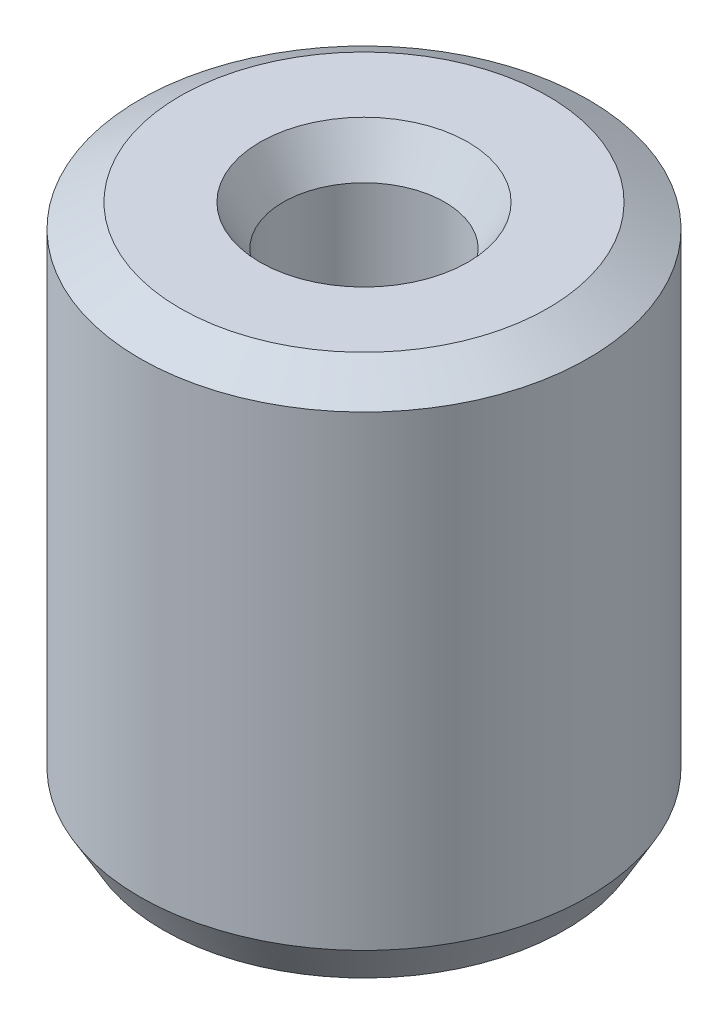
ISO-10303-21;
HEADER;
FILE_DESCRIPTION(('STEP AP214'),'2;1');
FILE_NAME('part.step','',(''),(''),'','','');
FILE_SCHEMA(('AUTOMOTIVE_DESIGN { 1 0 10303 214 1 1 1 1 }'));
ENDSEC;
DATA;
#1=APPLICATION_CONTEXT('core data for automotive mechanical design processes');
#2=APPLICATION_PROTOCOL_DEFINITION('international standard','automotive_design',2000,#1);
#3=PRODUCT_CONTEXT('',#1,'mechanical');
#4=PRODUCT('Part','Part','',(#3));
#5=PRODUCT_RELATED_PRODUCT_CATEGORY('part','',(#4));
#6=PRODUCT_DEFINITION_FORMATION('','',#4);
#7=PRODUCT_DEFINITION_CONTEXT('part definition',#1,'design');
#8=PRODUCT_DEFINITION('design','',#6,#7);
#9=PRODUCT_DEFINITION_SHAPE('','',#8);
#10=(LENGTH_UNIT() NAMED_UNIT(*) SI_UNIT(.MILLI.,.METRE.));
#11=(NAMED_UNIT(*) PLANE_ANGLE_UNIT() SI_UNIT($,.RADIAN.));
#12=(NAMED_UNIT(*) SI_UNIT($,.STERADIAN.) SOLID_ANGLE_UNIT());
#13=UNCERTAINTY_MEASURE_WITH_UNIT(LENGTH_MEASURE(1.E-05),#10,'distance_accuracy_value','');
#14=(GEOMETRIC_REPRESENTATION_CONTEXT(3) GLOBAL_UNCERTAINTY_ASSIGNED_CONTEXT((#13)) GLOBAL_UNIT_ASSIGNED_CONTEXT((#10,
#11,#12)) REPRESENTATION_CONTEXT('',''));
#15=CARTESIAN_POINT('',(0.,0.,0.));
#16=DIRECTION('',(0.,0.,1.));
#17=DIRECTION('',(1.,0.,0.));
#18=AXIS2_PLACEMENT_3D('',#15,#16,#17);
#19=CARTESIAN_POINT('',(0.,29.5413175582798,0.));
#20=DIRECTION('',(0.,-1.,0.));
#21=DIRECTION('',(0.,0.,-1.));
#22=AXIS2_PLACEMENT_3D('',#19,#20,#21);
#23=CYLINDRICAL_SURFACE('',#22,12.5);
#24=CARTESIAN_POINT('',(0.,2.24704750951922,0.));
#25=DIRECTION('',(0.,1.,0.));
#26=DIRECTION('',(0.,0.,1.));
#27=AXIS2_PLACEMENT_3D('',#24,#25,#26);
#28=CIRCLE('',#27,12.5);
#29=CARTESIAN_POINT('',(0.,2.24704750951922,12.5));
#30=VERTEX_POINT('',#29);
#31=EDGE_CURVE('E10',#30,#30,#28,.T.);
#32=ORIENTED_EDGE('',*,*,#31,.T.);
#33=EDGE_LOOP('',(#32));
#34=FACE_BOUND('',#33,.T.);
#35=CARTESIAN_POINT('',(0.,28.243984073777,0.));
#36=DIRECTION('',(0.,1.,0.));
#37=DIRECTION('',(0.,0.,1.));
#38=AXIS2_PLACEMENT_3D('',#35,#36,#37);
#39=CIRCLE('',#38,12.5);
#40=CARTESIAN_POINT('',(0.,28.243984073777,12.5));
#41=VERTEX_POINT('',#40);
#42=EDGE_CURVE('E50',#41,#41,#39,.F.);
#43=ORIENTED_EDGE('',*,*,#42,.T.);
#44=EDGE_LOOP('',(#43));
#45=FACE_BOUND('',#44,.T.);
#46=ADVANCED_FACE('F39',(#34,#45),#23,.T.);
#47=CARTESIAN_POINT('',(0.,29.5413175582798,0.));
#48=DIRECTION('',(0.,1.,0.));
#49=DIRECTION('',(0.,0.,1.));
#50=AXIS2_PLACEMENT_3D('',#47,#48,#49);
#51=PLANE('',#50);
#52=CARTESIAN_POINT('',(0.,29.5413175582798,0.));
#53=DIRECTION('',(0.,1.,0.));
#54=DIRECTION('',(0.,0.,1.));
#55=AXIS2_PLACEMENT_3D('',#52,#53,#54);
#56=CIRCLE('',#55,5.80007910251227);
#57=CARTESIAN_POINT('',(0.,29.5413175582798,5.80007910251227));
#58=VERTEX_POINT('',#57);
#59=EDGE_CURVE('E58',#58,#58,#56,.F.);
#60=ORIENTED_EDGE('',*,*,#59,.T.);
#61=EDGE_LOOP('',(#60));
#62=FACE_BOUND('',#61,.T.);
#63=CARTESIAN_POINT('',(0.,29.5413175582798,0.));
#64=DIRECTION('',(0.,1.,0.));
#65=DIRECTION('',(0.,0.,1.));
#66=AXIS2_PLACEMENT_3D('',#63,#64,#65);
#67=CIRCLE('',#66,10.2529524904808);
#68=CARTESIAN_POINT('',(0.,29.5413175582798,10.2529524904808));
#69=VERTEX_POINT('',#68);
#70=EDGE_CURVE('E61',#69,#69,#67,.T.);
#71=ORIENTED_EDGE('',*,*,#70,.T.);
#72=EDGE_LOOP('',(#71));
#73=FACE_BOUND('',#72,.T.);
#74=ADVANCED_FACE('F88',(#62,#73),#51,.T.);
#75=CARTESIAN_POINT('',(0.,0.,0.));
#76=DIRECTION('',(0.,1.,0.));
#77=DIRECTION('',(0.,0.,1.));
#78=AXIS2_PLACEMENT_3D('',#75,#76,#77);
#79=PLANE('',#78);
#80=CARTESIAN_POINT('',(0.,0.,0.));
#81=DIRECTION('',(0.,1.,0.));
#82=DIRECTION('',(0.,0.,1.));
#83=AXIS2_PLACEMENT_3D('',#80,#81,#82);
#84=CIRCLE('',#83,6.74979312752869);
#85=CARTESIAN_POINT('',(0.,0.,6.74979312752869));
#86=VERTEX_POINT('',#85);
#87=EDGE_CURVE('E51',#86,#86,#84,.T.);
#88=ORIENTED_EDGE('',*,*,#87,.T.);
#89=EDGE_LOOP('',(#88));
#90=FACE_BOUND('',#89,.T.);
#91=CARTESIAN_POINT('',(0.,0.,0.));
#92=DIRECTION('',(0.,1.,0.));
#93=DIRECTION('',(0.,0.,1.));
#94=AXIS2_PLACEMENT_3D('',#91,#92,#93);
#95=CIRCLE('',#94,11.2026665154972);
#96=CARTESIAN_POINT('',(0.,0.,11.2026665154972));
#97=VERTEX_POINT('',#96);
#98=EDGE_CURVE('E54',#97,#97,#95,.F.);
#99=ORIENTED_EDGE('',*,*,#98,.T.);
#100=EDGE_LOOP('',(#99));
#101=FACE_BOUND('',#100,.T.);
#102=ADVANCED_FACE('F83',(#90,#101),#79,.F.);
#103=CARTESIAN_POINT('',(0.,29.5413175582798,0.));
#104=DIRECTION('',(0.,-1.,0.));
#105=DIRECTION('',(0.,0.,-1.));
#106=AXIS2_PLACEMENT_3D('',#103,#104,#105);
#107=CYLINDRICAL_SURFACE('',#106,4.50274561800946);
#108=CARTESIAN_POINT('',(0.,27.2942700487606,0.));
#109=DIRECTION('',(0.,1.,0.));
#110=DIRECTION('',(0.,0.,1.));
#111=AXIS2_PLACEMENT_3D('',#108,#109,#110);
#112=CIRCLE('',#111,4.50274561800946);
#113=CARTESIAN_POINT('',(0.,27.2942700487606,4.50274561800946));
#114=VERTEX_POINT('',#113);
#115=EDGE_CURVE('E67',#114,#114,#112,.T.);
#116=ORIENTED_EDGE('',*,*,#115,.T.);
#117=EDGE_LOOP('',(#116));
#118=FACE_BOUND('',#117,.T.);
#119=CARTESIAN_POINT('',(0.,1.29733348450282,0.));
#120=DIRECTION('',(0.,1.,0.));
#121=DIRECTION('',(0.,0.,1.));
#122=AXIS2_PLACEMENT_3D('',#119,#120,#121);
#123=CIRCLE('',#122,4.50274561800946);
#124=CARTESIAN_POINT('',(0.,1.29733348450282,4.50274561800946));
#125=VERTEX_POINT('',#124);
#126=EDGE_CURVE('E69',#125,#125,#123,.F.);
#127=ORIENTED_EDGE('',*,*,#126,.T.);
#128=EDGE_LOOP('',(#127));
#129=FACE_BOUND('',#128,.T.);
#130=ADVANCED_FACE('F71',(#118,#129),#107,.F.);
#131=CARTESIAN_POINT('',(0.,27.2942700487606,0.));
#132=DIRECTION('',(0.,1.,0.));
#133=DIRECTION('',(0.,0.,1.));
#134=AXIS2_PLACEMENT_3D('',#131,#132,#133);
#135=CONICAL_SURFACE('',#134,4.50274561800946,0.523598775598303);
#136=ORIENTED_EDGE('',*,*,#59,.F.);
#137=EDGE_LOOP('',(#136));
#138=FACE_BOUND('',#137,.T.);
#139=ORIENTED_EDGE('',*,*,#115,.F.);
#140=EDGE_LOOP('',(#139));
#141=FACE_BOUND('',#140,.T.);
#142=ADVANCED_FACE('F77',(#138,#141),#135,.F.);
#143=CARTESIAN_POINT('',(0.,0.,0.));
#144=DIRECTION('',(0.,-1.,0.));
#145=DIRECTION('',(0.,0.,-1.));
#146=AXIS2_PLACEMENT_3D('',#143,#144,#145);
#147=CONICAL_SURFACE('',#146,6.74979312752869,1.04719755119659);
#148=ORIENTED_EDGE('',*,*,#126,.F.);
#149=EDGE_LOOP('',(#148));
#150=FACE_BOUND('',#149,.T.);
#151=ORIENTED_EDGE('',*,*,#87,.F.);
#152=EDGE_LOOP('',(#151));
#153=FACE_BOUND('',#152,.T.);
#154=ADVANCED_FACE('F73',(#150,#153),#147,.F.);
#155=CARTESIAN_POINT('',(0.,2.24704750951922,0.));
#156=DIRECTION('',(0.,1.,0.));
#157=DIRECTION('',(0.,0.,1.));
#158=AXIS2_PLACEMENT_3D('',#155,#156,#157);
#159=CONICAL_SURFACE('',#158,12.5,0.523598775598303);
#160=CARTESIAN_POINT('',(0.,0.,11.2026665154972));
#161=CARTESIAN_POINT('',(0.,0.0234067448908251,11.2161804059608));
#162=CARTESIAN_POINT('',(0.,0.0468134897816502,11.2296942964243));
#163=CARTESIAN_POINT('',(0.,0.0936269795633006,11.2567220773515));
#164=CARTESIAN_POINT('',(0.,0.117033724454126,11.270235967815));
#165=CARTESIAN_POINT('',(0.,0.163847214235776,11.2972637487422));
#166=CARTESIAN_POINT('',(0.,0.187253959126602,11.3107776392058));
#167=CARTESIAN_POINT('',(0.,0.234067448908252,11.3378054201329));
#168=CARTESIAN_POINT('',(0.,0.257474193799077,11.3513193105965));
#169=CARTESIAN_POINT('',(0.,0.304287683580728,11.3783470915236));
#170=CARTESIAN_POINT('',(0.,0.327694428471553,11.3918609819872));
#171=CARTESIAN_POINT('',(0.,0.374507918253203,11.4188887629143));
#172=CARTESIAN_POINT('',(0.,0.397914663144029,11.4324026533779));
#173=CARTESIAN_POINT('',(0.,0.444728152925679,11.459430434305));
#174=CARTESIAN_POINT('',(0.,0.468134897816505,11.4729443247686));
#175=CARTESIAN_POINT('',(0.,0.514948387598155,11.4999721056957));
#176=CARTESIAN_POINT('',(0.,0.53835513248898,11.5134859961593));
#177=CARTESIAN_POINT('',(0.,0.585168622270631,11.5405137770865));
#178=CARTESIAN_POINT('',(0.,0.608575367161456,11.55402766755));
#179=CARTESIAN_POINT('',(0.,0.655388856943107,11.5810554484772));
#180=CARTESIAN_POINT('',(0.,0.678795601833932,11.5945693389407));
#181=CARTESIAN_POINT('',(0.,0.725609091615582,11.6215971198679));
#182=CARTESIAN_POINT('',(0.,0.749015836506408,11.6351110103315));
#183=CARTESIAN_POINT('',(0.,0.795829326288058,11.6621387912586));
#184=CARTESIAN_POINT('',(0.,0.819236071178883,11.6756526817222));
#185=CARTESIAN_POINT('',(0.,0.866049560960534,11.7026804626493));
#186=CARTESIAN_POINT('',(0.,0.889456305851359,11.7161943531129));
#187=CARTESIAN_POINT('',(0.,0.93626979563301,11.74322213404));
#188=CARTESIAN_POINT('',(0.,0.959676540523835,11.7567360245036));
#189=CARTESIAN_POINT('',(0.,1.00649003030549,11.7837638054307));
#190=CARTESIAN_POINT('',(0.,1.02989677519631,11.7972776958943));
#191=CARTESIAN_POINT('',(0.,1.07671026497796,11.8243054768215));
#192=CARTESIAN_POINT('',(0.,1.10011700986879,11.837819367285));
#193=CARTESIAN_POINT('',(0.,1.14693049965044,11.8648471482122));
#194=CARTESIAN_POINT('',(0.,1.17033724454126,11.8783610386757));
#195=CARTESIAN_POINT('',(0.,1.21715073432291,11.9053888196029));
#196=CARTESIAN_POINT('',(0.,1.24055747921374,11.9189027100664));
#197=CARTESIAN_POINT('',(0.,1.28737096899539,11.9459304909936));
#198=CARTESIAN_POINT('',(0.,1.31077771388621,11.9594443814572));
#199=CARTESIAN_POINT('',(0.,1.35759120366786,11.9864721623843));
#200=CARTESIAN_POINT('',(0.,1.38099794855869,11.9999860528479));
#201=CARTESIAN_POINT('',(0.,1.42781143834034,12.027013833775));
#202=CARTESIAN_POINT('',(0.,1.45121818323117,12.0405277242386));
#203=CARTESIAN_POINT('',(0.,1.49803167301282,12.0675555051657));
#204=CARTESIAN_POINT('',(0.,1.52143841790364,12.0810693956293));
#205=CARTESIAN_POINT('',(0.,1.56825190768529,12.1080971765564));
#206=CARTESIAN_POINT('',(0.,1.59165865257612,12.12161106702));
#207=CARTESIAN_POINT('',(0.,1.63847214235777,12.1486388479472));
#208=CARTESIAN_POINT('',(0.,1.66187888724859,12.1621527384107));
#209=CARTESIAN_POINT('',(0.,1.70869237703024,12.1891805193379));
#210=CARTESIAN_POINT('',(0.,1.73209912192107,12.2026944098014));
#211=CARTESIAN_POINT('',(0.,1.77891261170272,12.2297221907286));
#212=CARTESIAN_POINT('',(0.,1.80231935659354,12.2432360811922));
#213=CARTESIAN_POINT('',(0.,1.84913284637519,12.2702638621193));
#214=CARTESIAN_POINT('',(0.,1.87253959126602,12.2837777525829));
#215=CARTESIAN_POINT('',(0.,1.91935308104767,12.31080553351));
#216=CARTESIAN_POINT('',(0.,1.9427598259385,12.3243194239736));
#217=CARTESIAN_POINT('',(0.,1.98957331572015,12.3513472049007));
#218=CARTESIAN_POINT('',(0.,2.01298006061097,12.3648610953643));
#219=CARTESIAN_POINT('',(0.,2.05979355039262,12.3918888762914));
#220=CARTESIAN_POINT('',(0.,2.08320029528345,12.405402766755));
#221=CARTESIAN_POINT('',(0.,2.1300137850651,12.4324305476821));
#222=CARTESIAN_POINT('',(0.,2.15342052995592,12.4459444381457));
#223=CARTESIAN_POINT('',(0.,2.20023401973757,12.4729722190729));
#224=CARTESIAN_POINT('',(0.,2.2236407646284,12.4864861095364));
#225=CARTESIAN_POINT('',(0.,2.24704750951922,12.5));
#226=B_SPLINE_CURVE_WITH_KNOTS('',3,(#160,#161,#162,#163,#164,#165,#166,#167,#168,#169,#170,
#171,#172,#173,#174,#175,#176,#177,#178,#179,#180,#181,#182,#183,#184,#185,#186,#187,#188,#189,
#190,#191,#192,#193,#194,#195,#196,#197,#198,#199,#200,#201,#202,#203,#204,#205,#206,#207,#208,
#209,#210,#211,#212,#213,#214,#215,#216,#217,#218,#219,#220,#221,#222,#223,#224,#225),
.UNSPECIFIED.,.F.,.F.,(4,2,2,2,2,2,2,2,2,2,2,2,2,2,2,2,2,2,2,2,2,2,2,2,2,2,2,2,2,2,2,2,4),(0.,
0.0810833427814247,0.162166685562851,0.243250028344275,0.324333371125701,0.405416713907127,
0.486500056688552,0.567583399469977,0.648666742251403,0.729750085032828,0.810833427814254,
0.891916770595678,0.973000113377104,1.05408345615853,1.13516679893995,1.21625014172138,
1.29733348450281,1.37841682728423,1.45950017006566,1.54058351284708,1.62166685562851,
1.70275019840993,1.78383354119136,1.86491688397278,1.94600022675421,2.02708356953563,
2.10816691231706,2.18925025509848,2.27033359787991,2.35141694066133,2.43250028344276,
2.51358362622419,2.59466696900561),.UNSPECIFIED.);
#227=EDGE_CURVE('BSEAM76',#97,#30,#226,.T.);
#228=ORIENTED_EDGE('',*,*,#98,.F.);
#229=ORIENTED_EDGE('',*,*,#31,.F.);
#230=ORIENTED_EDGE('',*,*,#227,.T.);
#231=ORIENTED_EDGE('',*,*,#227,.F.);
#232=EDGE_LOOP('',(#228,#230,#229,#231));
#233=FACE_BOUND('',#232,.T.);
#234=ADVANCED_FACE('F76',(#233),#159,.T.);
#235=CARTESIAN_POINT('',(0.,29.5413175582798,0.));
#236=DIRECTION('',(0.,-1.,0.));
#237=DIRECTION('',(0.,0.,-1.));
#238=AXIS2_PLACEMENT_3D('',#235,#236,#237);
#239=CONICAL_SURFACE('',#238,10.2529524904808,1.04719755119659);
#240=ORIENTED_EDGE('',*,*,#42,.F.);
#241=EDGE_LOOP('',(#240));
#242=FACE_BOUND('',#241,.T.);
#243=ORIENTED_EDGE('',*,*,#70,.F.);
#244=EDGE_LOOP('',(#243));
#245=FACE_BOUND('',#244,.T.);
#246=ADVANCED_FACE('F45',(#242,#245),#239,.T.);
#247=CLOSED_SHELL('',(#46,#74,#102,#130,#142,#154,#234,#246));
#248=MANIFOLD_SOLID_BREP('B2',#247);
#249=ADVANCED_BREP_SHAPE_REPRESENTATION('',(#18,#248),#14);
#250=SHAPE_DEFINITION_REPRESENTATION(#9,#249);
ENDSEC;
END-ISO-10303-21;
